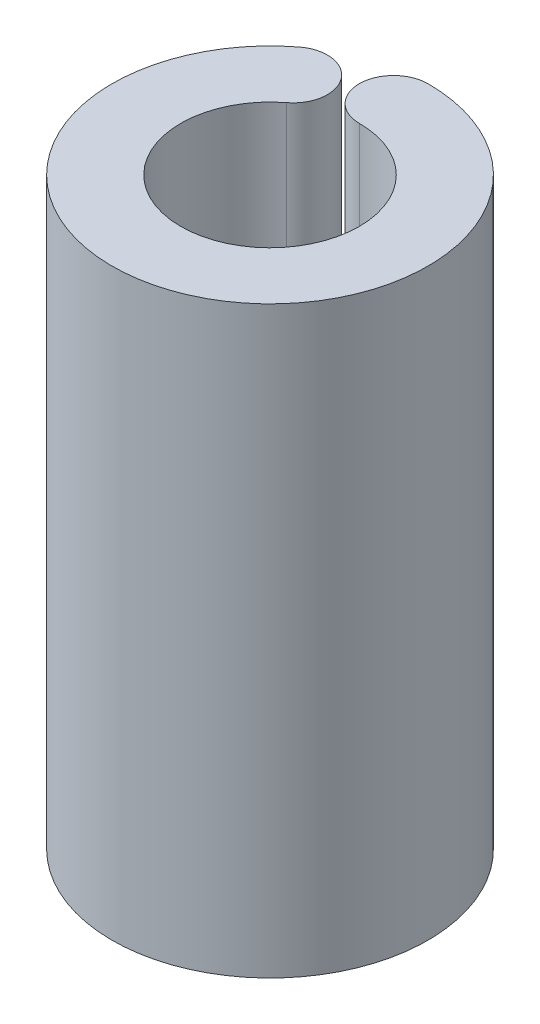
ISO-10303-21;
HEADER;
FILE_DESCRIPTION(('STEP AP214'),'2;1');
FILE_NAME('part.step','',(''),(''),'','','');
FILE_SCHEMA(('AUTOMOTIVE_DESIGN { 1 0 10303 214 1 1 1 1 }'));
ENDSEC;
DATA;
#1=APPLICATION_CONTEXT('core data for automotive mechanical design processes');
#2=APPLICATION_PROTOCOL_DEFINITION('international standard','automotive_design',2000,#1);
#3=PRODUCT_CONTEXT('',#1,'mechanical');
#4=PRODUCT('Part','Part','',(#3));
#5=PRODUCT_RELATED_PRODUCT_CATEGORY('part','',(#4));
#6=PRODUCT_DEFINITION_FORMATION('','',#4);
#7=PRODUCT_DEFINITION_CONTEXT('part definition',#1,'design');
#8=PRODUCT_DEFINITION('design','',#6,#7);
#9=PRODUCT_DEFINITION_SHAPE('','',#8);
#10=(LENGTH_UNIT() NAMED_UNIT(*) SI_UNIT(.MILLI.,.METRE.));
#11=(NAMED_UNIT(*) PLANE_ANGLE_UNIT() SI_UNIT($,.RADIAN.));
#12=(NAMED_UNIT(*) SI_UNIT($,.STERADIAN.) SOLID_ANGLE_UNIT());
#13=UNCERTAINTY_MEASURE_WITH_UNIT(LENGTH_MEASURE(1.E-05),#10,'distance_accuracy_value','');
#14=(GEOMETRIC_REPRESENTATION_CONTEXT(3) GLOBAL_UNCERTAINTY_ASSIGNED_CONTEXT((#13)) GLOBAL_UNIT_ASSIGNED_CONTEXT((#10,
#11,#12)) REPRESENTATION_CONTEXT('',''));
#15=CARTESIAN_POINT('',(0.,0.,0.));
#16=DIRECTION('',(0.,0.,1.));
#17=DIRECTION('',(1.,0.,0.));
#18=AXIS2_PLACEMENT_3D('',#15,#16,#17);
#19=CARTESIAN_POINT('',(0.,17.,0.));
#20=DIRECTION('',(0.,-1.,0.));
#21=DIRECTION('',(0.,0.,-1.));
#22=AXIS2_PLACEMENT_3D('',#19,#20,#21);
#23=CYLINDRICAL_SURFACE('',#22,2.6);
#24=CARTESIAN_POINT('',(0.,0.,0.));
#25=DIRECTION('',(0.,1.,0.));
#26=DIRECTION('',(0.,0.,1.));
#27=AXIS2_PLACEMENT_3D('',#24,#25,#26);
#28=CIRCLE('',#27,2.6);
#29=CARTESIAN_POINT('',(0.,0.,-2.6));
#30=VERTEX_POINT('',#29);
#31=CARTESIAN_POINT('',(-1.57975097216721,0.,-2.06503919234884));
#32=VERTEX_POINT('',#31);
#33=EDGE_CURVE('E98',#30,#32,#28,.F.);
#34=ORIENTED_EDGE('',*,*,#33,.T.);
#35=DIRECTION('',(0.,-1.,0.));
#36=VECTOR('',#35,1.);
#37=CARTESIAN_POINT('',(-1.57975097216721,17.,-2.06503919234884));
#38=LINE('',#37,#36);
#39=CARTESIAN_POINT('',(-1.57975097216721,17.,-2.06503919234884));
#40=VERTEX_POINT('',#39);
#41=EDGE_CURVE('E11',#40,#32,#38,.T.);
#42=ORIENTED_EDGE('',*,*,#41,.F.);
#43=CARTESIAN_POINT('',(0.,17.,0.));
#44=DIRECTION('',(0.,1.,0.));
#45=DIRECTION('',(0.,0.,1.));
#46=AXIS2_PLACEMENT_3D('',#43,#44,#45);
#47=CIRCLE('',#46,2.6);
#48=CARTESIAN_POINT('',(0.,17.,-2.6));
#49=VERTEX_POINT('',#48);
#50=EDGE_CURVE('E84',#49,#40,#47,.F.);
#51=ORIENTED_EDGE('',*,*,#50,.F.);
#52=DIRECTION('',(0.,-1.,0.));
#53=VECTOR('',#52,1.);
#54=CARTESIAN_POINT('',(0.,17.,-2.6));
#55=LINE('',#54,#53);
#56=EDGE_CURVE('E51',#49,#30,#55,.T.);
#57=ORIENTED_EDGE('',*,*,#56,.T.);
#58=EDGE_LOOP('',(#34,#42,#51,#57));
#59=FACE_BOUND('',#58,.T.);
#60=ADVANCED_FACE('F35',(#59),#23,.F.);
#61=CARTESIAN_POINT('',(-2.18734749992382,17.,-2.85928503555994));
#62=DIRECTION('',(0.,-1.,0.));
#63=DIRECTION('',(0.,0.,-1.));
#64=AXIS2_PLACEMENT_3D('',#61,#62,#63);
#65=CYLINDRICAL_SURFACE('',#64,1.);
#66=CARTESIAN_POINT('',(-2.18734749992382,0.,-2.85928503555994));
#67=DIRECTION('',(0.,1.,0.));
#68=DIRECTION('',(0.,0.,1.));
#69=AXIS2_PLACEMENT_3D('',#66,#67,#68);
#70=CIRCLE('',#69,1.);
#71=CARTESIAN_POINT('',(-2.79494402768044,0.,-3.65353087877103));
#72=VERTEX_POINT('',#71);
#73=EDGE_CURVE('E89',#32,#72,#70,.T.);
#74=ORIENTED_EDGE('',*,*,#73,.T.);
#75=DIRECTION('',(0.,-1.,0.));
#76=VECTOR('',#75,1.);
#77=CARTESIAN_POINT('',(-2.79494402768044,17.,-3.65353087877103));
#78=LINE('',#77,#76);
#79=CARTESIAN_POINT('',(-2.79494402768044,17.,-3.65353087877103));
#80=VERTEX_POINT('',#79);
#81=EDGE_CURVE('E43',#80,#72,#78,.T.);
#82=ORIENTED_EDGE('',*,*,#81,.F.);
#83=CARTESIAN_POINT('',(-2.18734749992382,17.,-2.85928503555994));
#84=DIRECTION('',(0.,1.,0.));
#85=DIRECTION('',(0.,0.,1.));
#86=AXIS2_PLACEMENT_3D('',#83,#84,#85);
#87=CIRCLE('',#86,1.);
#88=EDGE_CURVE('E76',#40,#80,#87,.T.);
#89=ORIENTED_EDGE('',*,*,#88,.F.);
#90=ORIENTED_EDGE('',*,*,#41,.T.);
#91=EDGE_LOOP('',(#74,#82,#89,#90));
#92=FACE_BOUND('',#91,.T.);
#93=ADVANCED_FACE('F88',(#92),#65,.T.);
#94=CARTESIAN_POINT('',(0.,17.,0.));
#95=DIRECTION('',(0.,-1.,0.));
#96=DIRECTION('',(0.,0.,-1.));
#97=AXIS2_PLACEMENT_3D('',#94,#95,#96);
#98=CYLINDRICAL_SURFACE('',#97,4.6);
#99=CARTESIAN_POINT('',(0.,0.,0.));
#100=DIRECTION('',(0.,1.,0.));
#101=DIRECTION('',(0.,0.,1.));
#102=AXIS2_PLACEMENT_3D('',#99,#100,#101);
#103=CIRCLE('',#102,4.6);
#104=CARTESIAN_POINT('',(0.,0.,-4.6));
#105=VERTEX_POINT('',#104);
#106=EDGE_CURVE('E101',#105,#72,#103,.F.);
#107=ORIENTED_EDGE('',*,*,#106,.F.);
#108=DIRECTION('',(0.,-1.,0.));
#109=VECTOR('',#108,1.);
#110=CARTESIAN_POINT('',(0.,17.,-4.6));
#111=LINE('',#110,#109);
#112=CARTESIAN_POINT('',(0.,17.,-4.6));
#113=VERTEX_POINT('',#112);
#114=EDGE_CURVE('E65',#113,#105,#111,.T.);
#115=ORIENTED_EDGE('',*,*,#114,.F.);
#116=CARTESIAN_POINT('',(0.,17.,0.));
#117=DIRECTION('',(0.,1.,0.));
#118=DIRECTION('',(0.,0.,1.));
#119=AXIS2_PLACEMENT_3D('',#116,#117,#118);
#120=CIRCLE('',#119,4.6);
#121=EDGE_CURVE('E83',#113,#80,#120,.F.);
#122=ORIENTED_EDGE('',*,*,#121,.T.);
#123=ORIENTED_EDGE('',*,*,#81,.T.);
#124=EDGE_LOOP('',(#107,#115,#122,#123));
#125=FACE_BOUND('',#124,.T.);
#126=ADVANCED_FACE('F92',(#125),#98,.T.);
#127=CARTESIAN_POINT('',(0.,17.,-3.6));
#128=DIRECTION('',(0.,-1.,0.));
#129=DIRECTION('',(0.,0.,-1.));
#130=AXIS2_PLACEMENT_3D('',#127,#128,#129);
#131=CYLINDRICAL_SURFACE('',#130,1.);
#132=CARTESIAN_POINT('',(0.,0.,-3.6));
#133=DIRECTION('',(0.,1.,0.));
#134=DIRECTION('',(0.,0.,1.));
#135=AXIS2_PLACEMENT_3D('',#132,#133,#134);
#136=CIRCLE('',#135,1.);
#137=EDGE_CURVE('E103',#30,#105,#136,.F.);
#138=ORIENTED_EDGE('',*,*,#137,.F.);
#139=ORIENTED_EDGE('',*,*,#56,.F.);
#140=CARTESIAN_POINT('',(0.,17.,-3.6));
#141=DIRECTION('',(0.,1.,0.));
#142=DIRECTION('',(0.,0.,1.));
#143=AXIS2_PLACEMENT_3D('',#140,#141,#142);
#144=CIRCLE('',#143,1.);
#145=EDGE_CURVE('E93',#49,#113,#144,.F.);
#146=ORIENTED_EDGE('',*,*,#145,.T.);
#147=ORIENTED_EDGE('',*,*,#114,.T.);
#148=EDGE_LOOP('',(#138,#139,#146,#147));
#149=FACE_BOUND('',#148,.T.);
#150=ADVANCED_FACE('F109',(#149),#131,.T.);
#151=CARTESIAN_POINT('',(0.,17.,0.));
#152=DIRECTION('',(0.,1.,0.));
#153=DIRECTION('',(0.,0.,1.));
#154=AXIS2_PLACEMENT_3D('',#151,#152,#153);
#155=PLANE('',#154);
#156=ORIENTED_EDGE('',*,*,#50,.T.);
#157=ORIENTED_EDGE('',*,*,#88,.T.);
#158=ORIENTED_EDGE('',*,*,#121,.F.);
#159=ORIENTED_EDGE('',*,*,#145,.F.);
#160=EDGE_LOOP('',(#156,#157,#158,#159));
#161=FACE_BOUND('',#160,.T.);
#162=ADVANCED_FACE('F80',(#161),#155,.T.);
#163=CARTESIAN_POINT('',(0.,0.,0.));
#164=DIRECTION('',(0.,1.,0.));
#165=DIRECTION('',(0.,0.,1.));
#166=AXIS2_PLACEMENT_3D('',#163,#164,#165);
#167=PLANE('',#166);
#168=ORIENTED_EDGE('',*,*,#33,.F.);
#169=ORIENTED_EDGE('',*,*,#137,.T.);
#170=ORIENTED_EDGE('',*,*,#106,.T.);
#171=ORIENTED_EDGE('',*,*,#73,.F.);
#172=EDGE_LOOP('',(#168,#169,#170,#171));
#173=FACE_BOUND('',#172,.T.);
#174=ADVANCED_FACE('F108',(#173),#167,.F.);
#175=CLOSED_SHELL('',(#60,#93,#126,#150,#162,#174));
#176=MANIFOLD_SOLID_BREP('B2',#175);
#177=ADVANCED_BREP_SHAPE_REPRESENTATION('',(#18,#176),#14);
#178=SHAPE_DEFINITION_REPRESENTATION(#9,#177);
ENDSEC;
END-ISO-10303-21;
